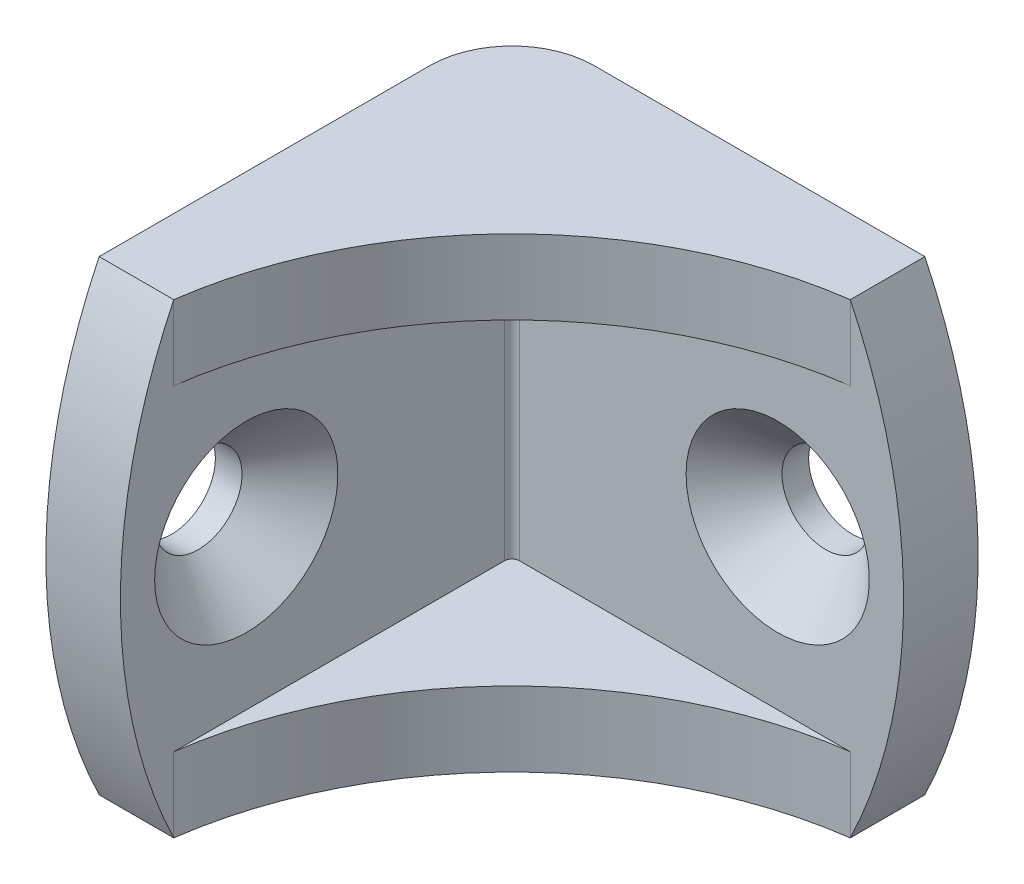
ISO-10303-21;
HEADER;
FILE_DESCRIPTION(('STEP AP214'),'2;1');
FILE_NAME('part.step','',(''),(''),'','','');
FILE_SCHEMA(('AUTOMOTIVE_DESIGN { 1 0 10303 214 1 1 1 1 }'));
ENDSEC;
DATA;
#1=APPLICATION_CONTEXT('core data for automotive mechanical design processes');
#2=APPLICATION_PROTOCOL_DEFINITION('international standard','automotive_design',2000,#1);
#3=PRODUCT_CONTEXT('',#1,'mechanical');
#4=PRODUCT('Part','Part','',(#3));
#5=PRODUCT_RELATED_PRODUCT_CATEGORY('part','',(#4));
#6=PRODUCT_DEFINITION_FORMATION('','',#4);
#7=PRODUCT_DEFINITION_CONTEXT('part definition',#1,'design');
#8=PRODUCT_DEFINITION('design','',#6,#7);
#9=PRODUCT_DEFINITION_SHAPE('','',#8);
#10=(LENGTH_UNIT() NAMED_UNIT(*) SI_UNIT(.MILLI.,.METRE.));
#11=(NAMED_UNIT(*) PLANE_ANGLE_UNIT() SI_UNIT($,.RADIAN.));
#12=(NAMED_UNIT(*) SI_UNIT($,.STERADIAN.) SOLID_ANGLE_UNIT());
#13=UNCERTAINTY_MEASURE_WITH_UNIT(LENGTH_MEASURE(1.E-05),#10,'distance_accuracy_value','');
#14=(GEOMETRIC_REPRESENTATION_CONTEXT(3) GLOBAL_UNCERTAINTY_ASSIGNED_CONTEXT((#13)) GLOBAL_UNIT_ASSIGNED_CONTEXT((#10,
#11,#12)) REPRESENTATION_CONTEXT('',''));
#15=CARTESIAN_POINT('',(0.,0.,0.));
#16=DIRECTION('',(0.,0.,1.));
#17=DIRECTION('',(1.,0.,0.));
#18=AXIS2_PLACEMENT_3D('',#15,#16,#17);
#19=CARTESIAN_POINT('',(3.9116,11.1125,3.556));
#20=DIRECTION('',(0.,0.,-1.));
#21=DIRECTION('',(-1.,0.,0.));
#22=AXIS2_PLACEMENT_3D('',#19,#20,#21);
#23=PLANE('',#22);
#24=CARTESIAN_POINT('',(16.225,0.,3.556));
#25=DIRECTION('',(0.,0.,-1.));
#26=DIRECTION('',(-1.,0.,0.));
#27=AXIS2_PLACEMENT_3D('',#24,#25,#26);
#28=CIRCLE('',#27,4.3688);
#29=CARTESIAN_POINT('',(11.8562,0.,3.556));
#30=VERTEX_POINT('',#29);
#31=EDGE_CURVE('E183',#30,#30,#28,.T.);
#32=ORIENTED_EDGE('',*,*,#31,.T.);
#33=EDGE_LOOP('',(#32));
#34=FACE_BOUND('',#33,.T.);
#35=CARTESIAN_POINT('',(-3.35359375000001,0.,3.556));
#36=DIRECTION('',(0.,0.,-1.));
#37=DIRECTION('',(-1.,0.,0.));
#38=AXIS2_PLACEMENT_3D('',#35,#36,#37);
#39=CIRCLE('',#38,25.57859375);
#40=CARTESIAN_POINT('',(19.685,11.1125,3.55600000000002));
#41=VERTEX_POINT('',#40);
#42=CARTESIAN_POINT('',(19.685,-11.1125,3.556));
#43=VERTEX_POINT('',#42);
#44=EDGE_CURVE('E115',#41,#43,#39,.T.);
#45=ORIENTED_EDGE('',*,*,#44,.F.);
#46=DIRECTION('',(0.,1.,0.));
#47=VECTOR('',#46,1.);
#48=CARTESIAN_POINT('',(19.685,7.5565,3.556));
#49=LINE('',#48,#47);
#50=CARTESIAN_POINT('',(19.685,7.5565,3.556));
#51=VERTEX_POINT('',#50);
#52=EDGE_CURVE('E128',#51,#41,#49,.T.);
#53=ORIENTED_EDGE('',*,*,#52,.F.);
#54=DIRECTION('',(-1.,0.,0.));
#55=VECTOR('',#54,1.);
#56=CARTESIAN_POINT('',(3.9116,7.5565,3.556));
#57=LINE('',#56,#55);
#58=CARTESIAN_POINT('',(3.9116,7.5565,3.556));
#59=VERTEX_POINT('',#58);
#60=EDGE_CURVE('E400',#51,#59,#57,.T.);
#61=ORIENTED_EDGE('',*,*,#60,.T.);
#62=DIRECTION('',(0.,-1.,0.));
#63=VECTOR('',#62,1.);
#64=CARTESIAN_POINT('',(3.9116,11.1125,3.556));
#65=LINE('',#64,#63);
#66=CARTESIAN_POINT('',(3.9116,-7.5565,3.556));
#67=VERTEX_POINT('',#66);
#68=EDGE_CURVE('E163',#59,#67,#65,.T.);
#69=ORIENTED_EDGE('',*,*,#68,.T.);
#70=DIRECTION('',(-1.,0.,0.));
#71=VECTOR('',#70,1.);
#72=CARTESIAN_POINT('',(3.9116,-7.5565,3.556));
#73=LINE('',#72,#71);
#74=CARTESIAN_POINT('',(19.685,-7.5565,3.556));
#75=VERTEX_POINT('',#74);
#76=EDGE_CURVE('E391',#75,#67,#73,.T.);
#77=ORIENTED_EDGE('',*,*,#76,.F.);
#78=DIRECTION('',(0.,-1.,0.));
#79=VECTOR('',#78,1.);
#80=CARTESIAN_POINT('',(19.685,-7.5565,3.556));
#81=LINE('',#80,#79);
#82=EDGE_CURVE('E130',#75,#43,#81,.T.);
#83=ORIENTED_EDGE('',*,*,#82,.T.);
#84=EDGE_LOOP('',(#45,#53,#61,#69,#77,#83));
#85=FACE_BOUND('',#84,.T.);
#86=ADVANCED_FACE('F34',(#34,#85),#23,.F.);
#87=CARTESIAN_POINT('',(3.9116,11.1125,0.));
#88=DIRECTION('',(0.,0.,-1.));
#89=DIRECTION('',(-1.,0.,0.));
#90=AXIS2_PLACEMENT_3D('',#87,#88,#89);
#91=PLANE('',#90);
#92=CARTESIAN_POINT('',(16.225,0.,0.));
#93=DIRECTION('',(0.,0.,-1.));
#94=DIRECTION('',(-1.,0.,0.));
#95=AXIS2_PLACEMENT_3D('',#92,#93,#94);
#96=CIRCLE('',#95,2.0828);
#97=CARTESIAN_POINT('',(14.1422,0.,0.));
#98=VERTEX_POINT('',#97);
#99=EDGE_CURVE('E132',#98,#98,#96,.T.);
#100=ORIENTED_EDGE('',*,*,#99,.F.);
#101=EDGE_LOOP('',(#100));
#102=FACE_BOUND('',#101,.T.);
#103=DIRECTION('',(1.,0.,0.));
#104=VECTOR('',#103,1.);
#105=CARTESIAN_POINT('',(3.9116,11.1125,0.));
#106=LINE('',#105,#104);
#107=CARTESIAN_POINT('',(3.9116,11.1125,0.));
#108=VERTEX_POINT('',#107);
#109=CARTESIAN_POINT('',(19.685,11.1125,0.));
#110=VERTEX_POINT('',#109);
#111=EDGE_CURVE('E155',#108,#110,#106,.T.);
#112=ORIENTED_EDGE('',*,*,#111,.T.);
#113=CARTESIAN_POINT('',(-3.35359374999999,0.,0.));
#114=DIRECTION('',(0.,0.,-1.));
#115=DIRECTION('',(-1.,0.,0.));
#116=AXIS2_PLACEMENT_3D('',#113,#114,#115);
#117=CIRCLE('',#116,25.57859375);
#118=CARTESIAN_POINT('',(19.685,-11.1125,0.));
#119=VERTEX_POINT('',#118);
#120=EDGE_CURVE('E117',#110,#119,#117,.T.);
#121=ORIENTED_EDGE('',*,*,#120,.T.);
#122=DIRECTION('',(1.,0.,0.));
#123=VECTOR('',#122,1.);
#124=CARTESIAN_POINT('',(3.9116,-11.1125,0.));
#125=LINE('',#124,#123);
#126=CARTESIAN_POINT('',(3.9116,-11.1125,0.));
#127=VERTEX_POINT('',#126);
#128=EDGE_CURVE('E149',#127,#119,#125,.T.);
#129=ORIENTED_EDGE('',*,*,#128,.F.);
#130=DIRECTION('',(0.,-1.,0.));
#131=VECTOR('',#130,1.);
#132=CARTESIAN_POINT('',(3.9116,11.1125,0.));
#133=LINE('',#132,#131);
#134=EDGE_CURVE('E178',#108,#127,#133,.T.);
#135=ORIENTED_EDGE('',*,*,#134,.F.);
#136=EDGE_LOOP('',(#112,#121,#129,#135));
#137=FACE_BOUND('',#136,.T.);
#138=ADVANCED_FACE('F203',(#102,#137),#91,.T.);
#139=CARTESIAN_POINT('',(3.9116,11.1125,3.9116));
#140=DIRECTION('',(0.,-1.,0.));
#141=DIRECTION('',(-1.,0.,0.));
#142=AXIS2_PLACEMENT_3D('',#139,#140,#141);
#143=PLANE('',#142);
#144=DIRECTION('',(0.,0.,-1.));
#145=VECTOR('',#144,1.);
#146=CARTESIAN_POINT('',(19.6849999999998,11.1125,51.6745364977729));
#147=LINE('',#146,#145);
#148=EDGE_CURVE('E111',#41,#110,#147,.T.);
#149=ORIENTED_EDGE('',*,*,#148,.T.);
#150=ORIENTED_EDGE('',*,*,#111,.F.);
#151=CARTESIAN_POINT('',(3.9116,11.1125,3.9116));
#152=DIRECTION('',(0.,-1.,0.));
#153=DIRECTION('',(0.,0.,1.));
#154=AXIS2_PLACEMENT_3D('',#151,#152,#153);
#155=CIRCLE('',#154,3.9116);
#156=CARTESIAN_POINT('',(0.,11.1125,3.9116));
#157=VERTEX_POINT('',#156);
#158=EDGE_CURVE('E157',#157,#108,#155,.T.);
#159=ORIENTED_EDGE('',*,*,#158,.F.);
#160=DIRECTION('',(0.,0.,-1.));
#161=VECTOR('',#160,1.);
#162=CARTESIAN_POINT('',(0.,11.1125,22.225));
#163=LINE('',#162,#161);
#164=CARTESIAN_POINT('',(0.,11.1125,19.685));
#165=VERTEX_POINT('',#164);
#166=EDGE_CURVE('E161',#165,#157,#163,.T.);
#167=ORIENTED_EDGE('',*,*,#166,.F.);
#168=DIRECTION('',(-1.,0.,0.));
#169=VECTOR('',#168,1.);
#170=CARTESIAN_POINT('',(51.6745364977729,11.1125,19.685));
#171=LINE('',#170,#169);
#172=CARTESIAN_POINT('',(3.556,11.1125,19.685));
#173=VERTEX_POINT('',#172);
#174=EDGE_CURVE('E138',#173,#165,#171,.T.);
#175=ORIENTED_EDGE('',*,*,#174,.F.);
#176=CARTESIAN_POINT('',(22.225,11.1125,22.225));
#177=DIRECTION('',(0.,-1.,0.));
#178=DIRECTION('',(0.,0.,-1.));
#179=AXIS2_PLACEMENT_3D('',#176,#177,#178);
#180=CIRCLE('',#179,18.8409968154554);
#181=EDGE_CURVE('E135',#173,#41,#180,.T.);
#182=ORIENTED_EDGE('',*,*,#181,.T.);
#183=EDGE_LOOP('',(#149,#150,#159,#167,#175,#182));
#184=FACE_BOUND('',#183,.T.);
#185=ADVANCED_FACE('F136',(#184),#143,.F.);
#186=CARTESIAN_POINT('',(3.9116,-11.1125,3.9116));
#187=DIRECTION('',(0.,-1.,0.));
#188=DIRECTION('',(-1.,0.,0.));
#189=AXIS2_PLACEMENT_3D('',#186,#187,#188);
#190=PLANE('',#189);
#191=ORIENTED_EDGE('',*,*,#128,.T.);
#192=DIRECTION('',(0.,0.,-1.));
#193=VECTOR('',#192,1.);
#194=CARTESIAN_POINT('',(19.6849999999998,-11.1125,51.6745364977729));
#195=LINE('',#194,#193);
#196=EDGE_CURVE('E181',#119,#43,#195,.F.);
#197=ORIENTED_EDGE('',*,*,#196,.T.);
#198=CARTESIAN_POINT('',(22.225,-11.1125,22.225));
#199=DIRECTION('',(0.,-1.,0.));
#200=DIRECTION('',(0.,0.,-1.));
#201=AXIS2_PLACEMENT_3D('',#198,#199,#200);
#202=CIRCLE('',#201,18.8409968154554);
#203=CARTESIAN_POINT('',(3.556,-11.1125,19.685));
#204=VERTEX_POINT('',#203);
#205=EDGE_CURVE('E381',#204,#43,#202,.T.);
#206=ORIENTED_EDGE('',*,*,#205,.F.);
#207=DIRECTION('',(-1.,0.,0.));
#208=VECTOR('',#207,1.);
#209=CARTESIAN_POINT('',(51.6745364977729,-11.1125,19.685));
#210=LINE('',#209,#208);
#211=CARTESIAN_POINT('',(0.,-11.1125,19.685));
#212=VERTEX_POINT('',#211);
#213=EDGE_CURVE('E57',#212,#204,#210,.F.);
#214=ORIENTED_EDGE('',*,*,#213,.F.);
#215=DIRECTION('',(0.,0.,-1.));
#216=VECTOR('',#215,1.);
#217=CARTESIAN_POINT('',(0.,-11.1125,22.225));
#218=LINE('',#217,#216);
#219=CARTESIAN_POINT('',(0.,-11.1125,3.9116));
#220=VERTEX_POINT('',#219);
#221=EDGE_CURVE('E158',#212,#220,#218,.T.);
#222=ORIENTED_EDGE('',*,*,#221,.T.);
#223=CARTESIAN_POINT('',(3.9116,-11.1125,3.9116));
#224=DIRECTION('',(0.,-1.,0.));
#225=DIRECTION('',(0.,0.,1.));
#226=AXIS2_PLACEMENT_3D('',#223,#224,#225);
#227=CIRCLE('',#226,3.9116);
#228=EDGE_CURVE('E166',#220,#127,#227,.T.);
#229=ORIENTED_EDGE('',*,*,#228,.T.);
#230=EDGE_LOOP('',(#191,#197,#206,#214,#222,#229));
#231=FACE_BOUND('',#230,.T.);
#232=ADVANCED_FACE('F223',(#231),#190,.T.);
#233=CARTESIAN_POINT('',(3.556,11.1125,22.225));
#234=DIRECTION('',(-1.,0.,0.));
#235=DIRECTION('',(0.,0.,1.));
#236=AXIS2_PLACEMENT_3D('',#233,#234,#235);
#237=PLANE('',#236);
#238=CARTESIAN_POINT('',(3.556,0.,16.225));
#239=DIRECTION('',(-1.,0.,0.));
#240=DIRECTION('',(0.,0.,1.));
#241=AXIS2_PLACEMENT_3D('',#238,#239,#240);
#242=CIRCLE('',#241,4.3688);
#243=CARTESIAN_POINT('',(3.556,0.,20.5938));
#244=VERTEX_POINT('',#243);
#245=EDGE_CURVE('E11',#244,#244,#242,.T.);
#246=ORIENTED_EDGE('',*,*,#245,.T.);
#247=EDGE_LOOP('',(#246));
#248=FACE_BOUND('',#247,.T.);
#249=CARTESIAN_POINT('',(3.556,0.,-3.35359374999999));
#250=DIRECTION('',(-1.,0.,0.));
#251=DIRECTION('',(0.,0.,1.));
#252=AXIS2_PLACEMENT_3D('',#249,#250,#251);
#253=CIRCLE('',#252,25.57859375);
#254=EDGE_CURVE('E372',#173,#204,#253,.F.);
#255=ORIENTED_EDGE('',*,*,#254,.T.);
#256=DIRECTION('',(0.,-1.,0.));
#257=VECTOR('',#256,1.);
#258=CARTESIAN_POINT('',(3.556,-7.5565,19.685));
#259=LINE('',#258,#257);
#260=CARTESIAN_POINT('',(3.556,-7.5565,19.685));
#261=VERTEX_POINT('',#260);
#262=EDGE_CURVE('E394',#261,#204,#259,.T.);
#263=ORIENTED_EDGE('',*,*,#262,.F.);
#264=DIRECTION('',(0.,0.,1.));
#265=VECTOR('',#264,1.);
#266=CARTESIAN_POINT('',(3.556,-7.5565,19.685));
#267=LINE('',#266,#265);
#268=CARTESIAN_POINT('',(3.556,-7.5565,3.9116));
#269=VERTEX_POINT('',#268);
#270=EDGE_CURVE('E385',#269,#261,#267,.T.);
#271=ORIENTED_EDGE('',*,*,#270,.F.);
#272=DIRECTION('',(0.,-1.,0.));
#273=VECTOR('',#272,1.);
#274=CARTESIAN_POINT('',(3.556,11.1125,3.9116));
#275=LINE('',#274,#273);
#276=CARTESIAN_POINT('',(3.556,7.5565,3.9116));
#277=VERTEX_POINT('',#276);
#278=EDGE_CURVE('E172',#277,#269,#275,.T.);
#279=ORIENTED_EDGE('',*,*,#278,.F.);
#280=DIRECTION('',(0.,0.,1.));
#281=VECTOR('',#280,1.);
#282=CARTESIAN_POINT('',(3.556,7.5565,19.685));
#283=LINE('',#282,#281);
#284=CARTESIAN_POINT('',(3.556,7.5565,19.685));
#285=VERTEX_POINT('',#284);
#286=EDGE_CURVE('E147',#277,#285,#283,.T.);
#287=ORIENTED_EDGE('',*,*,#286,.T.);
#288=DIRECTION('',(0.,1.,0.));
#289=VECTOR('',#288,1.);
#290=CARTESIAN_POINT('',(3.556,7.5565,19.685));
#291=LINE('',#290,#289);
#292=EDGE_CURVE('E146',#285,#173,#291,.T.);
#293=ORIENTED_EDGE('',*,*,#292,.T.);
#294=EDGE_LOOP('',(#255,#263,#271,#279,#287,#293));
#295=FACE_BOUND('',#294,.T.);
#296=ADVANCED_FACE('F220',(#248,#295),#237,.F.);
#297=CARTESIAN_POINT('',(0.,11.1125,22.225));
#298=DIRECTION('',(-1.,0.,0.));
#299=DIRECTION('',(0.,0.,1.));
#300=AXIS2_PLACEMENT_3D('',#297,#298,#299);
#301=PLANE('',#300);
#302=CARTESIAN_POINT('',(0.,0.,-3.35359374999999));
#303=DIRECTION('',(-1.,0.,0.));
#304=DIRECTION('',(0.,0.,1.));
#305=AXIS2_PLACEMENT_3D('',#302,#303,#304);
#306=CIRCLE('',#305,25.57859375);
#307=EDGE_CURVE('E49',#165,#212,#306,.F.);
#308=ORIENTED_EDGE('',*,*,#307,.F.);
#309=ORIENTED_EDGE('',*,*,#166,.T.);
#310=DIRECTION('',(0.,-1.,0.));
#311=VECTOR('',#310,1.);
#312=CARTESIAN_POINT('',(0.,11.1125,3.9116));
#313=LINE('',#312,#311);
#314=EDGE_CURVE('E175',#157,#220,#313,.T.);
#315=ORIENTED_EDGE('',*,*,#314,.T.);
#316=ORIENTED_EDGE('',*,*,#221,.F.);
#317=EDGE_LOOP('',(#308,#309,#315,#316));
#318=FACE_BOUND('',#317,.T.);
#319=CARTESIAN_POINT('',(0.,0.,16.225));
#320=DIRECTION('',(1.,0.,0.));
#321=DIRECTION('',(0.,0.,-1.));
#322=AXIS2_PLACEMENT_3D('',#319,#320,#321);
#323=CIRCLE('',#322,2.0828);
#324=CARTESIAN_POINT('',(0.,0.,14.1422));
#325=VERTEX_POINT('',#324);
#326=EDGE_CURVE('E377',#325,#325,#323,.T.);
#327=ORIENTED_EDGE('',*,*,#326,.T.);
#328=EDGE_LOOP('',(#327));
#329=FACE_BOUND('',#328,.T.);
#330=ADVANCED_FACE('F216',(#318,#329),#301,.T.);
#331=CARTESIAN_POINT('',(3.9116,11.1125,3.9116));
#332=DIRECTION('',(0.,-1.,0.));
#333=DIRECTION('',(0.,0.,-1.));
#334=AXIS2_PLACEMENT_3D('',#331,#332,#333);
#335=CYLINDRICAL_SURFACE('',#334,3.9116);
#336=ORIENTED_EDGE('',*,*,#228,.F.);
#337=ORIENTED_EDGE('',*,*,#314,.F.);
#338=ORIENTED_EDGE('',*,*,#158,.T.);
#339=ORIENTED_EDGE('',*,*,#134,.T.);
#340=EDGE_LOOP('',(#336,#337,#338,#339));
#341=FACE_BOUND('',#340,.T.);
#342=ADVANCED_FACE('F212',(#341),#335,.T.);
#343=CARTESIAN_POINT('',(3.9116,11.1125,3.9116));
#344=DIRECTION('',(0.,-1.,0.));
#345=DIRECTION('',(0.,0.,-1.));
#346=AXIS2_PLACEMENT_3D('',#343,#344,#345);
#347=CYLINDRICAL_SURFACE('',#346,0.3556);
#348=ORIENTED_EDGE('',*,*,#278,.T.);
#349=CARTESIAN_POINT('',(3.9116,-7.5565,3.9116));
#350=DIRECTION('',(0.,1.,0.));
#351=DIRECTION('',(0.,0.,1.));
#352=AXIS2_PLACEMENT_3D('',#349,#350,#351);
#353=CIRCLE('',#352,0.3556);
#354=EDGE_CURVE('E388',#67,#269,#353,.T.);
#355=ORIENTED_EDGE('',*,*,#354,.F.);
#356=ORIENTED_EDGE('',*,*,#68,.F.);
#357=CARTESIAN_POINT('',(3.9116,7.5565,3.9116));
#358=DIRECTION('',(0.,1.,0.));
#359=DIRECTION('',(0.,0.,1.));
#360=AXIS2_PLACEMENT_3D('',#357,#358,#359);
#361=CIRCLE('',#360,0.3556);
#362=EDGE_CURVE('E152',#59,#277,#361,.T.);
#363=ORIENTED_EDGE('',*,*,#362,.T.);
#364=EDGE_LOOP('',(#348,#355,#356,#363));
#365=FACE_BOUND('',#364,.T.);
#366=ADVANCED_FACE('F215',(#365),#347,.F.);
#367=CARTESIAN_POINT('',(22.225,7.5565,22.225));
#368=DIRECTION('',(0.,1.,0.));
#369=DIRECTION('',(0.,0.,1.));
#370=AXIS2_PLACEMENT_3D('',#367,#368,#369);
#371=CYLINDRICAL_SURFACE('',#370,18.8409968154554);
#372=ORIENTED_EDGE('',*,*,#181,.F.);
#373=ORIENTED_EDGE('',*,*,#292,.F.);
#374=CARTESIAN_POINT('',(22.225,7.5565,22.225));
#375=DIRECTION('',(0.,-1.,0.));
#376=DIRECTION('',(0.,0.,-1.));
#377=AXIS2_PLACEMENT_3D('',#374,#375,#376);
#378=CIRCLE('',#377,18.8409968154554);
#379=EDGE_CURVE('E141',#285,#51,#378,.T.);
#380=ORIENTED_EDGE('',*,*,#379,.T.);
#381=ORIENTED_EDGE('',*,*,#52,.T.);
#382=EDGE_LOOP('',(#372,#373,#380,#381));
#383=FACE_BOUND('',#382,.T.);
#384=ADVANCED_FACE('F144',(#383),#371,.F.);
#385=CARTESIAN_POINT('',(22.225,7.5565,22.225));
#386=DIRECTION('',(0.,-1.,0.));
#387=DIRECTION('',(0.,0.,-1.));
#388=AXIS2_PLACEMENT_3D('',#385,#386,#387);
#389=PLANE('',#388);
#390=ORIENTED_EDGE('',*,*,#379,.F.);
#391=ORIENTED_EDGE('',*,*,#286,.F.);
#392=ORIENTED_EDGE('',*,*,#362,.F.);
#393=ORIENTED_EDGE('',*,*,#60,.F.);
#394=EDGE_LOOP('',(#390,#391,#392,#393));
#395=FACE_BOUND('',#394,.T.);
#396=ADVANCED_FACE('F234',(#395),#389,.T.);
#397=CARTESIAN_POINT('',(22.225,-7.5565,22.225));
#398=DIRECTION('',(0.,-1.,0.));
#399=DIRECTION('',(0.,0.,-1.));
#400=AXIS2_PLACEMENT_3D('',#397,#398,#399);
#401=CYLINDRICAL_SURFACE('',#400,18.8409968154554);
#402=ORIENTED_EDGE('',*,*,#205,.T.);
#403=ORIENTED_EDGE('',*,*,#82,.F.);
#404=CARTESIAN_POINT('',(22.225,-7.5565,22.225));
#405=DIRECTION('',(0.,-1.,0.));
#406=DIRECTION('',(0.,0.,-1.));
#407=AXIS2_PLACEMENT_3D('',#404,#405,#406);
#408=CIRCLE('',#407,18.8409968154554);
#409=EDGE_CURVE('E382',#261,#75,#408,.T.);
#410=ORIENTED_EDGE('',*,*,#409,.F.);
#411=ORIENTED_EDGE('',*,*,#262,.T.);
#412=EDGE_LOOP('',(#402,#403,#410,#411));
#413=FACE_BOUND('',#412,.T.);
#414=ADVANCED_FACE('F237',(#413),#401,.F.);
#415=CARTESIAN_POINT('',(22.225,-7.5565,22.225));
#416=DIRECTION('',(0.,1.,0.));
#417=DIRECTION('',(0.,0.,-1.));
#418=AXIS2_PLACEMENT_3D('',#415,#416,#417);
#419=PLANE('',#418);
#420=ORIENTED_EDGE('',*,*,#409,.T.);
#421=ORIENTED_EDGE('',*,*,#76,.T.);
#422=ORIENTED_EDGE('',*,*,#354,.T.);
#423=ORIENTED_EDGE('',*,*,#270,.T.);
#424=EDGE_LOOP('',(#420,#421,#422,#423));
#425=FACE_BOUND('',#424,.T.);
#426=ADVANCED_FACE('F241',(#425),#419,.T.);
#427=CARTESIAN_POINT('',(22.225,0.,16.225));
#428=DIRECTION('',(-1.,0.,0.));
#429=DIRECTION('',(0.,0.,1.));
#430=AXIS2_PLACEMENT_3D('',#427,#428,#429);
#431=CYLINDRICAL_SURFACE('',#430,2.0828);
#432=CARTESIAN_POINT('',(1.27000000000001,0.,16.225));
#433=DIRECTION('',(-1.,0.,0.));
#434=DIRECTION('',(0.,0.,1.));
#435=AXIS2_PLACEMENT_3D('',#432,#433,#434);
#436=CIRCLE('',#435,2.0828);
#437=CARTESIAN_POINT('',(1.27000000000001,0.,18.3078));
#438=VERTEX_POINT('',#437);
#439=EDGE_CURVE('E42',#438,#438,#436,.F.);
#440=ORIENTED_EDGE('',*,*,#439,.T.);
#441=EDGE_LOOP('',(#440));
#442=FACE_BOUND('',#441,.T.);
#443=ORIENTED_EDGE('',*,*,#326,.F.);
#444=EDGE_LOOP('',(#443));
#445=FACE_BOUND('',#444,.T.);
#446=ADVANCED_FACE('F191',(#442,#445),#431,.F.);
#447=CARTESIAN_POINT('',(51.6745364977729,0.,-3.35359374999999));
#448=DIRECTION('',(-1.,0.,0.));
#449=DIRECTION('',(0.,0.,1.));
#450=AXIS2_PLACEMENT_3D('',#447,#448,#449);
#451=CYLINDRICAL_SURFACE('',#450,25.57859375);
#452=ORIENTED_EDGE('',*,*,#213,.T.);
#453=ORIENTED_EDGE('',*,*,#254,.F.);
#454=ORIENTED_EDGE('',*,*,#174,.T.);
#455=ORIENTED_EDGE('',*,*,#307,.T.);
#456=EDGE_LOOP('',(#452,#453,#454,#455));
#457=FACE_BOUND('',#456,.T.);
#458=ADVANCED_FACE('F248',(#457),#451,.T.);
#459=CARTESIAN_POINT('',(16.2249999999999,0.,22.2250000000001));
#460=DIRECTION('',(0.,0.,-1.));
#461=DIRECTION('',(-1.,0.,0.));
#462=AXIS2_PLACEMENT_3D('',#459,#460,#461);
#463=CYLINDRICAL_SURFACE('',#462,2.0828);
#464=CARTESIAN_POINT('',(16.225,0.,1.26999999999999));
#465=DIRECTION('',(0.,0.,-1.));
#466=DIRECTION('',(-1.,0.,0.));
#467=AXIS2_PLACEMENT_3D('',#464,#465,#466);
#468=CIRCLE('',#467,2.0828);
#469=CARTESIAN_POINT('',(14.1422,0.,1.26999999999998));
#470=VERTEX_POINT('',#469);
#471=EDGE_CURVE('E186',#470,#470,#468,.F.);
#472=ORIENTED_EDGE('',*,*,#471,.T.);
#473=EDGE_LOOP('',(#472));
#474=FACE_BOUND('',#473,.T.);
#475=ORIENTED_EDGE('',*,*,#99,.T.);
#476=EDGE_LOOP('',(#475));
#477=FACE_BOUND('',#476,.T.);
#478=ADVANCED_FACE('F251',(#474,#477),#463,.F.);
#479=CARTESIAN_POINT('',(-3.35359375000018,0.,51.6745364977729));
#480=DIRECTION('',(0.,0.,-1.));
#481=DIRECTION('',(-1.,0.,0.));
#482=AXIS2_PLACEMENT_3D('',#479,#480,#481);
#483=CYLINDRICAL_SURFACE('',#482,25.57859375);
#484=ORIENTED_EDGE('',*,*,#148,.F.);
#485=ORIENTED_EDGE('',*,*,#44,.T.);
#486=ORIENTED_EDGE('',*,*,#196,.F.);
#487=ORIENTED_EDGE('',*,*,#120,.F.);
#488=EDGE_LOOP('',(#484,#485,#486,#487));
#489=FACE_BOUND('',#488,.T.);
#490=ADVANCED_FACE('F113',(#489),#483,.T.);
#491=CARTESIAN_POINT('',(16.225,0.,3.556));
#492=DIRECTION('',(0.,0.,1.));
#493=DIRECTION('',(1.,0.,0.));
#494=AXIS2_PLACEMENT_3D('',#491,#492,#493);
#495=CONICAL_SURFACE('',#494,4.36879999999999,0.785398163397445);
#496=ORIENTED_EDGE('',*,*,#471,.F.);
#497=EDGE_LOOP('',(#496));
#498=FACE_BOUND('',#497,.T.);
#499=ORIENTED_EDGE('',*,*,#31,.F.);
#500=EDGE_LOOP('',(#499));
#501=FACE_BOUND('',#500,.T.);
#502=ADVANCED_FACE('F195',(#498,#501),#495,.F.);
#503=CARTESIAN_POINT('',(1.27000000000001,0.,16.225));
#504=DIRECTION('',(1.,0.,0.));
#505=DIRECTION('',(0.,0.,-1.));
#506=AXIS2_PLACEMENT_3D('',#503,#504,#505);
#507=CONICAL_SURFACE('',#506,2.0828,0.785398163397451);
#508=ORIENTED_EDGE('',*,*,#245,.F.);
#509=EDGE_LOOP('',(#508));
#510=FACE_BOUND('',#509,.T.);
#511=ORIENTED_EDGE('',*,*,#439,.F.);
#512=EDGE_LOOP('',(#511));
#513=FACE_BOUND('',#512,.T.);
#514=ADVANCED_FACE('F36',(#510,#513),#507,.F.);
#515=CLOSED_SHELL('',(#86,#138,#185,#232,#296,#330,#342,#366,#384,#396,#414,#426,#446,#458,#478,
#490,#502,#514));
#516=MANIFOLD_SOLID_BREP('B2',#515);
#517=ADVANCED_BREP_SHAPE_REPRESENTATION('',(#18,#516),#14);
#518=SHAPE_DEFINITION_REPRESENTATION(#9,#517);
ENDSEC;
END-ISO-10303-21;
